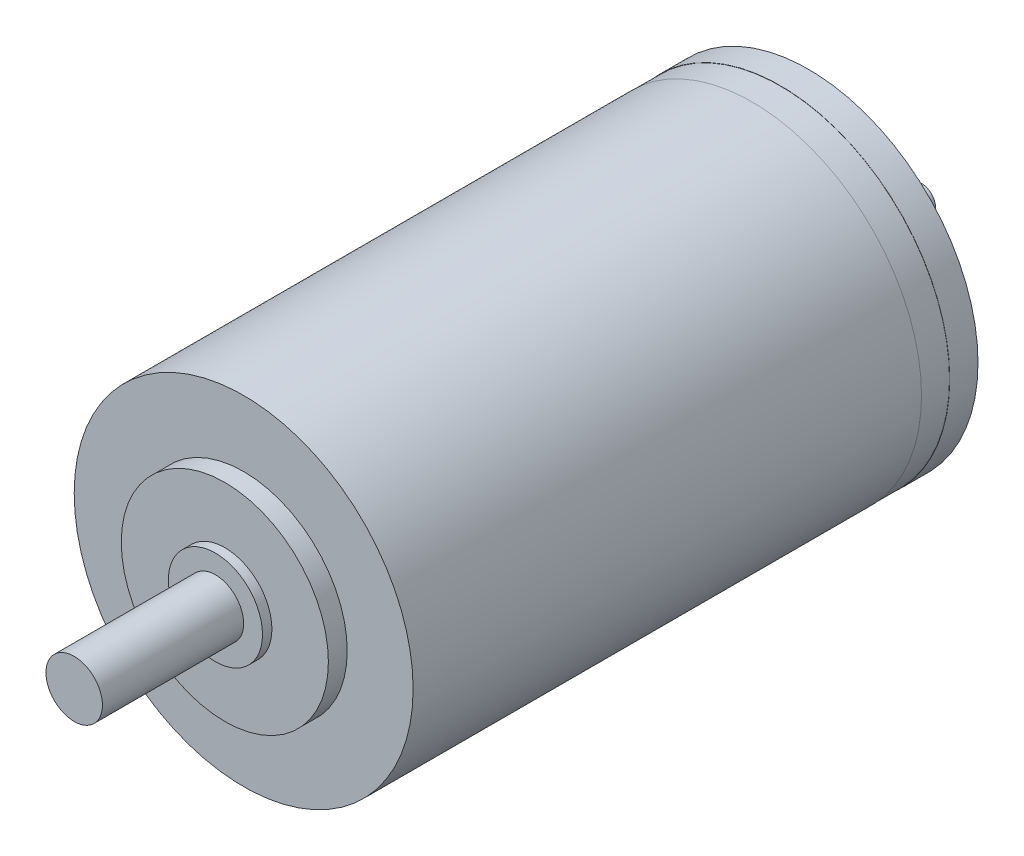
ISO-10303-21;
HEADER;
FILE_DESCRIPTION(('STEP AP214'),'2;1');
FILE_NAME('part.step','',(''),(''),'','','');
FILE_SCHEMA(('AUTOMOTIVE_DESIGN { 1 0 10303 214 1 1 1 1 }'));
ENDSEC;
DATA;
#1=APPLICATION_CONTEXT('core data for automotive mechanical design processes');
#2=APPLICATION_PROTOCOL_DEFINITION('international standard','automotive_design',2000,#1);
#3=PRODUCT_CONTEXT('',#1,'mechanical');
#4=PRODUCT('Part','Part','',(#3));
#5=PRODUCT_RELATED_PRODUCT_CATEGORY('part','',(#4));
#6=PRODUCT_DEFINITION_FORMATION('','',#4);
#7=PRODUCT_DEFINITION_CONTEXT('part definition',#1,'design');
#8=PRODUCT_DEFINITION('design','',#6,#7);
#9=PRODUCT_DEFINITION_SHAPE('','',#8);
#10=(LENGTH_UNIT() NAMED_UNIT(*) SI_UNIT(.MILLI.,.METRE.));
#11=(NAMED_UNIT(*) PLANE_ANGLE_UNIT() SI_UNIT($,.RADIAN.));
#12=(NAMED_UNIT(*) SI_UNIT($,.STERADIAN.) SOLID_ANGLE_UNIT());
#13=UNCERTAINTY_MEASURE_WITH_UNIT(LENGTH_MEASURE(1.E-05),#10,'distance_accuracy_value','');
#14=(GEOMETRIC_REPRESENTATION_CONTEXT(3) GLOBAL_UNCERTAINTY_ASSIGNED_CONTEXT((#13)) GLOBAL_UNIT_ASSIGNED_CONTEXT((#10,
#11,#12)) REPRESENTATION_CONTEXT('',''));
#15=CARTESIAN_POINT('',(0.,0.,0.));
#16=DIRECTION('',(0.,0.,1.));
#17=DIRECTION('',(1.,0.,0.));
#18=AXIS2_PLACEMENT_3D('',#15,#16,#17);
#19=CARTESIAN_POINT('',(0.,0.,3.));
#20=DIRECTION('',(0.,0.,-1.));
#21=DIRECTION('',(-1.,0.,0.));
#22=AXIS2_PLACEMENT_3D('',#19,#20,#21);
#23=CYLINDRICAL_SURFACE('',#22,17.975);
#24=CARTESIAN_POINT('',(0.,0.,3.));
#25=DIRECTION('',(0.,0.,1.));
#26=DIRECTION('',(1.,0.,0.));
#27=AXIS2_PLACEMENT_3D('',#24,#25,#26);
#28=CIRCLE('',#27,17.975);
#29=CARTESIAN_POINT('',(17.975,0.,3.));
#30=VERTEX_POINT('',#29);
#31=EDGE_CURVE('E10',#30,#30,#28,.T.);
#32=ORIENTED_EDGE('',*,*,#31,.F.);
#33=EDGE_LOOP('',(#32));
#34=FACE_BOUND('',#33,.T.);
#35=CARTESIAN_POINT('',(0.,0.,0.));
#36=DIRECTION('',(0.,0.,-1.));
#37=DIRECTION('',(-1.,0.,0.));
#38=AXIS2_PLACEMENT_3D('',#35,#36,#37);
#39=CIRCLE('',#38,17.975);
#40=CARTESIAN_POINT('',(-17.975,0.,0.));
#41=VERTEX_POINT('',#40);
#42=EDGE_CURVE('E65',#41,#41,#39,.T.);
#43=ORIENTED_EDGE('',*,*,#42,.F.);
#44=EDGE_LOOP('',(#43));
#45=FACE_BOUND('',#44,.T.);
#46=ADVANCED_FACE('F33',(#34,#45),#23,.T.);
#47=CARTESIAN_POINT('',(0.,0.,53.));
#48=DIRECTION('',(0.,0.,-1.));
#49=DIRECTION('',(-1.,0.,0.));
#50=AXIS2_PLACEMENT_3D('',#47,#48,#49);
#51=CYLINDRICAL_SURFACE('',#50,18.);
#52=CARTESIAN_POINT('',(0.,0.,3.));
#53=DIRECTION('',(0.,0.,1.));
#54=DIRECTION('',(1.,0.,0.));
#55=AXIS2_PLACEMENT_3D('',#52,#53,#54);
#56=CIRCLE('',#55,18.);
#57=CARTESIAN_POINT('',(18.,0.,3.));
#58=VERTEX_POINT('',#57);
#59=EDGE_CURVE('E39',#58,#58,#56,.T.);
#60=ORIENTED_EDGE('',*,*,#59,.T.);
#61=EDGE_LOOP('',(#60));
#62=FACE_BOUND('',#61,.T.);
#63=CARTESIAN_POINT('',(0.,0.,57.));
#64=DIRECTION('',(0.,0.,1.));
#65=DIRECTION('',(1.,0.,0.));
#66=AXIS2_PLACEMENT_3D('',#63,#64,#65);
#67=CIRCLE('',#66,18.);
#68=CARTESIAN_POINT('',(18.,0.,57.));
#69=VERTEX_POINT('',#68);
#70=EDGE_CURVE('E43',#69,#69,#67,.T.);
#71=ORIENTED_EDGE('',*,*,#70,.F.);
#72=EDGE_LOOP('',(#71));
#73=FACE_BOUND('',#72,.T.);
#74=ADVANCED_FACE('F129',(#62,#73),#51,.T.);
#75=CARTESIAN_POINT('',(0.,0.,3.));
#76=DIRECTION('',(0.,0.,1.));
#77=DIRECTION('',(1.,0.,0.));
#78=AXIS2_PLACEMENT_3D('',#75,#76,#77);
#79=PLANE('',#78);
#80=ORIENTED_EDGE('',*,*,#31,.T.);
#81=EDGE_LOOP('',(#80));
#82=FACE_BOUND('',#81,.T.);
#83=ORIENTED_EDGE('',*,*,#59,.F.);
#84=EDGE_LOOP('',(#83));
#85=FACE_BOUND('',#84,.T.);
#86=ADVANCED_FACE('F134',(#82,#85),#79,.F.);
#87=CARTESIAN_POINT('',(0.,0.,57.));
#88=DIRECTION('',(0.,0.,1.));
#89=DIRECTION('',(1.,0.,0.));
#90=AXIS2_PLACEMENT_3D('',#87,#88,#89);
#91=PLANE('',#90);
#92=CARTESIAN_POINT('',(0.,0.,57.));
#93=DIRECTION('',(0.,0.,1.));
#94=DIRECTION('',(1.,0.,0.));
#95=AXIS2_PLACEMENT_3D('',#92,#93,#94);
#96=CIRCLE('',#95,11.);
#97=CARTESIAN_POINT('',(11.,0.,57.));
#98=VERTEX_POINT('',#97);
#99=EDGE_CURVE('E50',#98,#98,#96,.T.);
#100=ORIENTED_EDGE('',*,*,#99,.F.);
#101=EDGE_LOOP('',(#100));
#102=FACE_BOUND('',#101,.T.);
#103=ORIENTED_EDGE('',*,*,#70,.T.);
#104=EDGE_LOOP('',(#103));
#105=FACE_BOUND('',#104,.T.);
#106=ADVANCED_FACE('F140',(#102,#105),#91,.T.);
#107=CARTESIAN_POINT('',(0.,0.,59.));
#108=DIRECTION('',(0.,0.,-1.));
#109=DIRECTION('',(-1.,0.,0.));
#110=AXIS2_PLACEMENT_3D('',#107,#108,#109);
#111=CYLINDRICAL_SURFACE('',#110,11.);
#112=CARTESIAN_POINT('',(0.,0.,59.));
#113=DIRECTION('',(0.,0.,1.));
#114=DIRECTION('',(1.,0.,0.));
#115=AXIS2_PLACEMENT_3D('',#112,#113,#114);
#116=CIRCLE('',#115,11.);
#117=CARTESIAN_POINT('',(11.,0.,59.));
#118=VERTEX_POINT('',#117);
#119=EDGE_CURVE('E47',#118,#118,#116,.T.);
#120=ORIENTED_EDGE('',*,*,#119,.F.);
#121=EDGE_LOOP('',(#120));
#122=FACE_BOUND('',#121,.T.);
#123=ORIENTED_EDGE('',*,*,#99,.T.);
#124=EDGE_LOOP('',(#123));
#125=FACE_BOUND('',#124,.T.);
#126=ADVANCED_FACE('F146',(#122,#125),#111,.T.);
#127=CARTESIAN_POINT('',(0.,0.,59.));
#128=DIRECTION('',(0.,0.,1.));
#129=DIRECTION('',(1.,0.,0.));
#130=AXIS2_PLACEMENT_3D('',#127,#128,#129);
#131=PLANE('',#130);
#132=CARTESIAN_POINT('',(0.,0.,59.));
#133=DIRECTION('',(0.,0.,1.));
#134=DIRECTION('',(1.,0.,0.));
#135=AXIS2_PLACEMENT_3D('',#132,#133,#134);
#136=CIRCLE('',#135,5.);
#137=CARTESIAN_POINT('',(5.,0.,59.));
#138=VERTEX_POINT('',#137);
#139=EDGE_CURVE('E56',#138,#138,#136,.T.);
#140=ORIENTED_EDGE('',*,*,#139,.F.);
#141=EDGE_LOOP('',(#140));
#142=FACE_BOUND('',#141,.T.);
#143=ORIENTED_EDGE('',*,*,#119,.T.);
#144=EDGE_LOOP('',(#143));
#145=FACE_BOUND('',#144,.T.);
#146=ADVANCED_FACE('F150',(#142,#145),#131,.T.);
#147=CARTESIAN_POINT('',(0.,0.,60.));
#148=DIRECTION('',(0.,0.,-1.));
#149=DIRECTION('',(-1.,0.,0.));
#150=AXIS2_PLACEMENT_3D('',#147,#148,#149);
#151=CYLINDRICAL_SURFACE('',#150,5.);
#152=CARTESIAN_POINT('',(0.,0.,60.));
#153=DIRECTION('',(0.,0.,1.));
#154=DIRECTION('',(1.,0.,0.));
#155=AXIS2_PLACEMENT_3D('',#152,#153,#154);
#156=CIRCLE('',#155,5.);
#157=CARTESIAN_POINT('',(5.,0.,60.));
#158=VERTEX_POINT('',#157);
#159=EDGE_CURVE('E53',#158,#158,#156,.T.);
#160=ORIENTED_EDGE('',*,*,#159,.F.);
#161=EDGE_LOOP('',(#160));
#162=FACE_BOUND('',#161,.T.);
#163=ORIENTED_EDGE('',*,*,#139,.T.);
#164=EDGE_LOOP('',(#163));
#165=FACE_BOUND('',#164,.T.);
#166=ADVANCED_FACE('F154',(#162,#165),#151,.T.);
#167=CARTESIAN_POINT('',(0.,0.,60.));
#168=DIRECTION('',(0.,0.,1.));
#169=DIRECTION('',(1.,0.,0.));
#170=AXIS2_PLACEMENT_3D('',#167,#168,#169);
#171=PLANE('',#170);
#172=CARTESIAN_POINT('',(0.,0.,60.));
#173=DIRECTION('',(0.,0.,1.));
#174=DIRECTION('',(1.,0.,0.));
#175=AXIS2_PLACEMENT_3D('',#172,#173,#174);
#176=CIRCLE('',#175,3.);
#177=CARTESIAN_POINT('',(3.,0.,60.));
#178=VERTEX_POINT('',#177);
#179=EDGE_CURVE('E62',#178,#178,#176,.T.);
#180=ORIENTED_EDGE('',*,*,#179,.F.);
#181=EDGE_LOOP('',(#180));
#182=FACE_BOUND('',#181,.T.);
#183=ORIENTED_EDGE('',*,*,#159,.T.);
#184=EDGE_LOOP('',(#183));
#185=FACE_BOUND('',#184,.T.);
#186=ADVANCED_FACE('F158',(#182,#185),#171,.T.);
#187=CARTESIAN_POINT('',(0.,0.,75.));
#188=DIRECTION('',(0.,0.,-1.));
#189=DIRECTION('',(-1.,0.,0.));
#190=AXIS2_PLACEMENT_3D('',#187,#188,#189);
#191=CYLINDRICAL_SURFACE('',#190,3.);
#192=CARTESIAN_POINT('',(0.,0.,75.));
#193=DIRECTION('',(0.,0.,1.));
#194=DIRECTION('',(1.,0.,0.));
#195=AXIS2_PLACEMENT_3D('',#192,#193,#194);
#196=CIRCLE('',#195,3.);
#197=CARTESIAN_POINT('',(3.,0.,75.));
#198=VERTEX_POINT('',#197);
#199=EDGE_CURVE('E59',#198,#198,#196,.T.);
#200=ORIENTED_EDGE('',*,*,#199,.F.);
#201=EDGE_LOOP('',(#200));
#202=FACE_BOUND('',#201,.T.);
#203=ORIENTED_EDGE('',*,*,#179,.T.);
#204=EDGE_LOOP('',(#203));
#205=FACE_BOUND('',#204,.T.);
#206=ADVANCED_FACE('F162',(#202,#205),#191,.T.);
#207=CARTESIAN_POINT('',(0.,0.,75.));
#208=DIRECTION('',(0.,0.,1.));
#209=DIRECTION('',(1.,0.,0.));
#210=AXIS2_PLACEMENT_3D('',#207,#208,#209);
#211=PLANE('',#210);
#212=ORIENTED_EDGE('',*,*,#199,.T.);
#213=EDGE_LOOP('',(#212));
#214=FACE_BOUND('',#213,.T.);
#215=ADVANCED_FACE('F119',(#214),#211,.T.);
#216=CARTESIAN_POINT('',(0.,0.,-3.));
#217=DIRECTION('',(0.,0.,1.));
#218=DIRECTION('',(1.,0.,0.));
#219=AXIS2_PLACEMENT_3D('',#216,#217,#218);
#220=CYLINDRICAL_SURFACE('',#219,18.);
#221=CARTESIAN_POINT('',(0.,0.,-3.));
#222=DIRECTION('',(0.,0.,-1.));
#223=DIRECTION('',(-1.,0.,0.));
#224=AXIS2_PLACEMENT_3D('',#221,#222,#223);
#225=CIRCLE('',#224,18.);
#226=CARTESIAN_POINT('',(-18.,0.,-3.));
#227=VERTEX_POINT('',#226);
#228=EDGE_CURVE('E70',#227,#227,#225,.T.);
#229=ORIENTED_EDGE('',*,*,#228,.F.);
#230=EDGE_LOOP('',(#229));
#231=FACE_BOUND('',#230,.T.);
#232=CARTESIAN_POINT('',(0.,0.,0.));
#233=DIRECTION('',(0.,0.,-1.));
#234=DIRECTION('',(-1.,0.,0.));
#235=AXIS2_PLACEMENT_3D('',#232,#233,#234);
#236=CIRCLE('',#235,18.);
#237=CARTESIAN_POINT('',(-18.,0.,0.));
#238=VERTEX_POINT('',#237);
#239=EDGE_CURVE('E71',#238,#238,#236,.T.);
#240=ORIENTED_EDGE('',*,*,#239,.T.);
#241=EDGE_LOOP('',(#240));
#242=FACE_BOUND('',#241,.T.);
#243=ADVANCED_FACE('F113',(#231,#242),#220,.T.);
#244=CARTESIAN_POINT('',(0.,0.,-3.));
#245=DIRECTION('',(0.,0.,-1.));
#246=DIRECTION('',(-1.,0.,0.));
#247=AXIS2_PLACEMENT_3D('',#244,#245,#246);
#248=PLANE('',#247);
#249=CARTESIAN_POINT('',(0.,0.,-3.));
#250=DIRECTION('',(0.,0.,-1.));
#251=DIRECTION('',(-1.,0.,0.));
#252=AXIS2_PLACEMENT_3D('',#249,#250,#251);
#253=CIRCLE('',#252,5.);
#254=CARTESIAN_POINT('',(-5.,0.,-3.));
#255=VERTEX_POINT('',#254);
#256=EDGE_CURVE('E77',#255,#255,#253,.T.);
#257=ORIENTED_EDGE('',*,*,#256,.F.);
#258=EDGE_LOOP('',(#257));
#259=FACE_BOUND('',#258,.T.);
#260=ORIENTED_EDGE('',*,*,#228,.T.);
#261=EDGE_LOOP('',(#260));
#262=FACE_BOUND('',#261,.T.);
#263=ADVANCED_FACE('F110',(#259,#262),#248,.T.);
#264=CARTESIAN_POINT('',(0.,0.,0.));
#265=DIRECTION('',(0.,0.,-1.));
#266=DIRECTION('',(-1.,0.,0.));
#267=AXIS2_PLACEMENT_3D('',#264,#265,#266);
#268=PLANE('',#267);
#269=ORIENTED_EDGE('',*,*,#42,.T.);
#270=EDGE_LOOP('',(#269));
#271=FACE_BOUND('',#270,.T.);
#272=ORIENTED_EDGE('',*,*,#239,.F.);
#273=EDGE_LOOP('',(#272));
#274=FACE_BOUND('',#273,.T.);
#275=ADVANCED_FACE('F106',(#271,#274),#268,.F.);
#276=CARTESIAN_POINT('',(0.,0.,-5.));
#277=DIRECTION('',(0.,0.,1.));
#278=DIRECTION('',(1.,0.,0.));
#279=AXIS2_PLACEMENT_3D('',#276,#277,#278);
#280=CYLINDRICAL_SURFACE('',#279,5.);
#281=CARTESIAN_POINT('',(0.,0.,-5.));
#282=DIRECTION('',(0.,0.,-1.));
#283=DIRECTION('',(-1.,0.,0.));
#284=AXIS2_PLACEMENT_3D('',#281,#282,#283);
#285=CIRCLE('',#284,5.);
#286=CARTESIAN_POINT('',(-5.,0.,-5.));
#287=VERTEX_POINT('',#286);
#288=EDGE_CURVE('E74',#287,#287,#285,.T.);
#289=ORIENTED_EDGE('',*,*,#288,.F.);
#290=EDGE_LOOP('',(#289));
#291=FACE_BOUND('',#290,.T.);
#292=ORIENTED_EDGE('',*,*,#256,.T.);
#293=EDGE_LOOP('',(#292));
#294=FACE_BOUND('',#293,.T.);
#295=ADVANCED_FACE('F100',(#291,#294),#280,.T.);
#296=CARTESIAN_POINT('',(0.,0.,-5.));
#297=DIRECTION('',(0.,0.,-1.));
#298=DIRECTION('',(-1.,0.,0.));
#299=AXIS2_PLACEMENT_3D('',#296,#297,#298);
#300=PLANE('',#299);
#301=CARTESIAN_POINT('',(0.,0.,-5.));
#302=DIRECTION('',(0.,0.,-1.));
#303=DIRECTION('',(-1.,0.,0.));
#304=AXIS2_PLACEMENT_3D('',#301,#302,#303);
#305=CIRCLE('',#304,1.5);
#306=CARTESIAN_POINT('',(-1.5,0.,-5.));
#307=VERTEX_POINT('',#306);
#308=EDGE_CURVE('E83',#307,#307,#305,.T.);
#309=ORIENTED_EDGE('',*,*,#308,.F.);
#310=EDGE_LOOP('',(#309));
#311=FACE_BOUND('',#310,.T.);
#312=ORIENTED_EDGE('',*,*,#288,.T.);
#313=EDGE_LOOP('',(#312));
#314=FACE_BOUND('',#313,.T.);
#315=ADVANCED_FACE('F94',(#311,#314),#300,.T.);
#316=CARTESIAN_POINT('',(0.,0.,-15.));
#317=DIRECTION('',(0.,0.,1.));
#318=DIRECTION('',(1.,0.,0.));
#319=AXIS2_PLACEMENT_3D('',#316,#317,#318);
#320=CYLINDRICAL_SURFACE('',#319,1.5);
#321=CARTESIAN_POINT('',(0.,0.,-15.));
#322=DIRECTION('',(0.,0.,-1.));
#323=DIRECTION('',(-1.,0.,0.));
#324=AXIS2_PLACEMENT_3D('',#321,#322,#323);
#325=CIRCLE('',#324,1.5);
#326=CARTESIAN_POINT('',(-1.5,0.,-15.));
#327=VERTEX_POINT('',#326);
#328=EDGE_CURVE('E80',#327,#327,#325,.T.);
#329=ORIENTED_EDGE('',*,*,#328,.F.);
#330=EDGE_LOOP('',(#329));
#331=FACE_BOUND('',#330,.T.);
#332=ORIENTED_EDGE('',*,*,#308,.T.);
#333=EDGE_LOOP('',(#332));
#334=FACE_BOUND('',#333,.T.);
#335=ADVANCED_FACE('F91',(#331,#334),#320,.T.);
#336=CARTESIAN_POINT('',(0.,0.,-15.));
#337=DIRECTION('',(0.,0.,-1.));
#338=DIRECTION('',(-1.,0.,0.));
#339=AXIS2_PLACEMENT_3D('',#336,#337,#338);
#340=PLANE('',#339);
#341=ORIENTED_EDGE('',*,*,#328,.T.);
#342=EDGE_LOOP('',(#341));
#343=FACE_BOUND('',#342,.T.);
#344=ADVANCED_FACE('F89',(#343),#340,.T.);
#345=CLOSED_SHELL('',(#46,#74,#86,#106,#126,#146,#166,#186,#206,#215,#243,#263,#275,#295,#315,
#335,#344));
#346=MANIFOLD_SOLID_BREP('B2',#345);
#347=ADVANCED_BREP_SHAPE_REPRESENTATION('',(#18,#346),#14);
#348=SHAPE_DEFINITION_REPRESENTATION(#9,#347);
ENDSEC;
END-ISO-10303-21;
